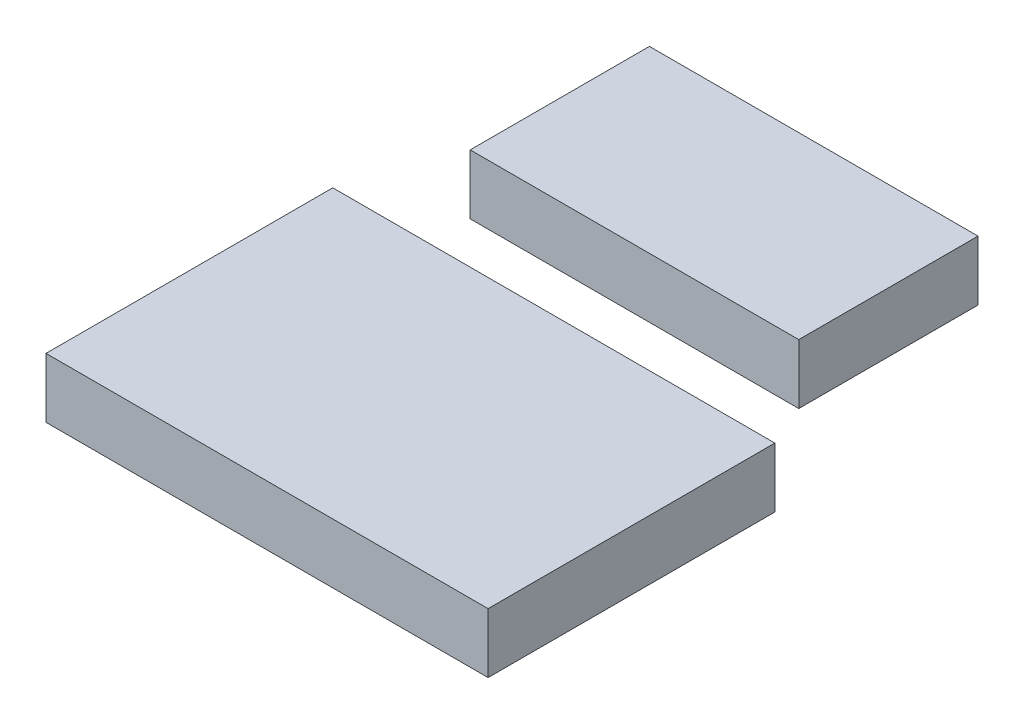
ISO-10303-21;
HEADER;
FILE_DESCRIPTION(('STEP AP214'),'2;1');
FILE_NAME('part.step','',(''),(''),'','','');
FILE_SCHEMA(('AUTOMOTIVE_DESIGN { 1 0 10303 214 1 1 1 1 }'));
ENDSEC;
DATA;
#1=APPLICATION_CONTEXT('core data for automotive mechanical design processes');
#2=APPLICATION_PROTOCOL_DEFINITION('international standard','automotive_design',2000,#1);
#3=PRODUCT_CONTEXT('',#1,'mechanical');
#4=PRODUCT('Part','Part','',(#3));
#5=PRODUCT_RELATED_PRODUCT_CATEGORY('part','',(#4));
#6=PRODUCT_DEFINITION_FORMATION('','',#4);
#7=PRODUCT_DEFINITION_CONTEXT('part definition',#1,'design');
#8=PRODUCT_DEFINITION('design','',#6,#7);
#9=PRODUCT_DEFINITION_SHAPE('','',#8);
#10=(LENGTH_UNIT() NAMED_UNIT(*) SI_UNIT(.MILLI.,.METRE.));
#11=(NAMED_UNIT(*) PLANE_ANGLE_UNIT() SI_UNIT($,.RADIAN.));
#12=(NAMED_UNIT(*) SI_UNIT($,.STERADIAN.) SOLID_ANGLE_UNIT());
#13=UNCERTAINTY_MEASURE_WITH_UNIT(LENGTH_MEASURE(1.E-05),#10,'distance_accuracy_value','');
#14=(GEOMETRIC_REPRESENTATION_CONTEXT(3) GLOBAL_UNCERTAINTY_ASSIGNED_CONTEXT((#13)) GLOBAL_UNIT_ASSIGNED_CONTEXT((#10,
#11,#12)) REPRESENTATION_CONTEXT('',''));
#15=CARTESIAN_POINT('',(0.,0.,0.));
#16=DIRECTION('',(0.,0.,1.));
#17=DIRECTION('',(1.,0.,0.));
#18=AXIS2_PLACEMENT_3D('',#15,#16,#17);
#19=CARTESIAN_POINT('',(-31.,10.,0.));
#20=DIRECTION('',(1.,0.,0.));
#21=DIRECTION('',(0.,0.,-1.));
#22=AXIS2_PLACEMENT_3D('',#19,#20,#21);
#23=PLANE('',#22);
#24=DIRECTION('',(0.,0.,1.));
#25=VECTOR('',#24,1.);
#26=CARTESIAN_POINT('',(-31.,0.,0.));
#27=LINE('',#26,#25);
#28=CARTESIAN_POINT('',(-31.,0.,-47.5));
#29=VERTEX_POINT('',#28);
#30=CARTESIAN_POINT('',(-31.,0.,-17.5));
#31=VERTEX_POINT('',#30);
#32=EDGE_CURVE('E105',#29,#31,#27,.T.);
#33=ORIENTED_EDGE('',*,*,#32,.T.);
#34=DIRECTION('',(0.,-1.,0.));
#35=VECTOR('',#34,1.);
#36=CARTESIAN_POINT('',(-31.,10.,-17.5));
#37=LINE('',#36,#35);
#38=CARTESIAN_POINT('',(-31.,10.,-17.5));
#39=VERTEX_POINT('',#38);
#40=EDGE_CURVE('E12',#39,#31,#37,.T.);
#41=ORIENTED_EDGE('',*,*,#40,.F.);
#42=DIRECTION('',(0.,0.,1.));
#43=VECTOR('',#42,1.);
#44=CARTESIAN_POINT('',(-31.,10.,0.));
#45=LINE('',#44,#43);
#46=CARTESIAN_POINT('',(-31.,10.,-47.5));
#47=VERTEX_POINT('',#46);
#48=EDGE_CURVE('E91',#47,#39,#45,.T.);
#49=ORIENTED_EDGE('',*,*,#48,.F.);
#50=DIRECTION('',(0.,-1.,0.));
#51=VECTOR('',#50,1.);
#52=CARTESIAN_POINT('',(-31.,10.,-47.5));
#53=LINE('',#52,#51);
#54=EDGE_CURVE('E58',#47,#29,#53,.T.);
#55=ORIENTED_EDGE('',*,*,#54,.T.);
#56=EDGE_LOOP('',(#33,#41,#49,#55));
#57=FACE_BOUND('',#56,.T.);
#58=ADVANCED_FACE('F42',(#57),#23,.F.);
#59=CARTESIAN_POINT('',(0.,10.,-17.5));
#60=DIRECTION('',(0.,0.,-1.));
#61=DIRECTION('',(-1.,0.,0.));
#62=AXIS2_PLACEMENT_3D('',#59,#60,#61);
#63=PLANE('',#62);
#64=DIRECTION('',(1.,0.,0.));
#65=VECTOR('',#64,1.);
#66=CARTESIAN_POINT('',(0.,0.,-17.5));
#67=LINE('',#66,#65);
#68=CARTESIAN_POINT('',(24.,0.,-17.5));
#69=VERTEX_POINT('',#68);
#70=EDGE_CURVE('E96',#31,#69,#67,.T.);
#71=ORIENTED_EDGE('',*,*,#70,.T.);
#72=DIRECTION('',(0.,-1.,0.));
#73=VECTOR('',#72,1.);
#74=CARTESIAN_POINT('',(24.,10.,-17.5));
#75=LINE('',#74,#73);
#76=CARTESIAN_POINT('',(24.,10.,-17.5));
#77=VERTEX_POINT('',#76);
#78=EDGE_CURVE('E50',#77,#69,#75,.T.);
#79=ORIENTED_EDGE('',*,*,#78,.F.);
#80=DIRECTION('',(1.,0.,0.));
#81=VECTOR('',#80,1.);
#82=CARTESIAN_POINT('',(0.,10.,-17.5));
#83=LINE('',#82,#81);
#84=EDGE_CURVE('E83',#39,#77,#83,.T.);
#85=ORIENTED_EDGE('',*,*,#84,.F.);
#86=ORIENTED_EDGE('',*,*,#40,.T.);
#87=EDGE_LOOP('',(#71,#79,#85,#86));
#88=FACE_BOUND('',#87,.T.);
#89=ADVANCED_FACE('F95',(#88),#63,.F.);
#90=CARTESIAN_POINT('',(24.,10.,0.));
#91=DIRECTION('',(1.,0.,0.));
#92=DIRECTION('',(0.,0.,-1.));
#93=AXIS2_PLACEMENT_3D('',#90,#91,#92);
#94=PLANE('',#93);
#95=DIRECTION('',(0.,0.,1.));
#96=VECTOR('',#95,1.);
#97=CARTESIAN_POINT('',(24.,0.,0.));
#98=LINE('',#97,#96);
#99=CARTESIAN_POINT('',(24.,0.,-47.5));
#100=VERTEX_POINT('',#99);
#101=EDGE_CURVE('E108',#100,#69,#98,.T.);
#102=ORIENTED_EDGE('',*,*,#101,.F.);
#103=DIRECTION('',(0.,-1.,0.));
#104=VECTOR('',#103,1.);
#105=CARTESIAN_POINT('',(24.,10.,-47.5));
#106=LINE('',#105,#104);
#107=CARTESIAN_POINT('',(24.,10.,-47.5));
#108=VERTEX_POINT('',#107);
#109=EDGE_CURVE('E72',#108,#100,#106,.T.);
#110=ORIENTED_EDGE('',*,*,#109,.F.);
#111=DIRECTION('',(0.,0.,1.));
#112=VECTOR('',#111,1.);
#113=CARTESIAN_POINT('',(24.,10.,0.));
#114=LINE('',#113,#112);
#115=EDGE_CURVE('E90',#108,#77,#114,.T.);
#116=ORIENTED_EDGE('',*,*,#115,.T.);
#117=ORIENTED_EDGE('',*,*,#78,.T.);
#118=EDGE_LOOP('',(#102,#110,#116,#117));
#119=FACE_BOUND('',#118,.T.);
#120=ADVANCED_FACE('F99',(#119),#94,.T.);
#121=CARTESIAN_POINT('',(0.,10.,-47.5));
#122=DIRECTION('',(0.,0.,-1.));
#123=DIRECTION('',(-1.,0.,0.));
#124=AXIS2_PLACEMENT_3D('',#121,#122,#123);
#125=PLANE('',#124);
#126=DIRECTION('',(1.,0.,0.));
#127=VECTOR('',#126,1.);
#128=CARTESIAN_POINT('',(0.,0.,-47.5));
#129=LINE('',#128,#127);
#130=EDGE_CURVE('E110',#29,#100,#129,.T.);
#131=ORIENTED_EDGE('',*,*,#130,.F.);
#132=ORIENTED_EDGE('',*,*,#54,.F.);
#133=DIRECTION('',(1.,0.,0.));
#134=VECTOR('',#133,1.);
#135=CARTESIAN_POINT('',(0.,10.,-47.5));
#136=LINE('',#135,#134);
#137=EDGE_CURVE('E100',#47,#108,#136,.T.);
#138=ORIENTED_EDGE('',*,*,#137,.T.);
#139=ORIENTED_EDGE('',*,*,#109,.T.);
#140=EDGE_LOOP('',(#131,#132,#138,#139));
#141=FACE_BOUND('',#140,.T.);
#142=ADVANCED_FACE('F116',(#141),#125,.T.);
#143=CARTESIAN_POINT('',(0.,10.,0.));
#144=DIRECTION('',(0.,1.,0.));
#145=DIRECTION('',(0.,0.,1.));
#146=AXIS2_PLACEMENT_3D('',#143,#144,#145);
#147=PLANE('',#146);
#148=ORIENTED_EDGE('',*,*,#48,.T.);
#149=ORIENTED_EDGE('',*,*,#84,.T.);
#150=ORIENTED_EDGE('',*,*,#115,.F.);
#151=ORIENTED_EDGE('',*,*,#137,.F.);
#152=EDGE_LOOP('',(#148,#149,#150,#151));
#153=FACE_BOUND('',#152,.T.);
#154=ADVANCED_FACE('F87',(#153),#147,.T.);
#155=CARTESIAN_POINT('',(0.,0.,0.));
#156=DIRECTION('',(0.,1.,0.));
#157=DIRECTION('',(0.,0.,1.));
#158=AXIS2_PLACEMENT_3D('',#155,#156,#157);
#159=PLANE('',#158);
#160=ORIENTED_EDGE('',*,*,#32,.F.);
#161=ORIENTED_EDGE('',*,*,#130,.T.);
#162=ORIENTED_EDGE('',*,*,#101,.T.);
#163=ORIENTED_EDGE('',*,*,#70,.F.);
#164=EDGE_LOOP('',(#160,#161,#162,#163));
#165=FACE_BOUND('',#164,.T.);
#166=ADVANCED_FACE('F115',(#165),#159,.F.);
#167=CLOSED_SHELL('',(#58,#89,#120,#142,#154,#166));
#168=MANIFOLD_SOLID_BREP('B2',#167);
#169=CARTESIAN_POINT('',(0.,10.,-0.5));
#170=DIRECTION('',(0.,0.,-1.));
#171=DIRECTION('',(-1.,0.,0.));
#172=AXIS2_PLACEMENT_3D('',#169,#170,#171);
#173=PLANE('',#172);
#174=DIRECTION('',(1.,0.,0.));
#175=VECTOR('',#174,1.);
#176=CARTESIAN_POINT('',(0.,0.,-0.5));
#177=LINE('',#176,#175);
#178=CARTESIAN_POINT('',(-37.,0.,-0.5));
#179=VERTEX_POINT('',#178);
#180=CARTESIAN_POINT('',(37.,0.,-0.5));
#181=VERTEX_POINT('',#180);
#182=EDGE_CURVE('E240',#179,#181,#177,.T.);
#183=ORIENTED_EDGE('',*,*,#182,.F.);
#184=DIRECTION('',(0.,-1.,0.));
#185=VECTOR('',#184,1.);
#186=CARTESIAN_POINT('',(-37.,10.,-0.5));
#187=LINE('',#186,#185);
#188=CARTESIAN_POINT('',(-37.,10.,-0.5));
#189=VERTEX_POINT('',#188);
#190=EDGE_CURVE('E40',#189,#179,#187,.T.);
#191=ORIENTED_EDGE('',*,*,#190,.F.);
#192=DIRECTION('',(1.,0.,0.));
#193=VECTOR('',#192,1.);
#194=CARTESIAN_POINT('',(0.,10.,-0.5));
#195=LINE('',#194,#193);
#196=CARTESIAN_POINT('',(37.,10.,-0.5));
#197=VERTEX_POINT('',#196);
#198=EDGE_CURVE('E225',#189,#197,#195,.T.);
#199=ORIENTED_EDGE('',*,*,#198,.T.);
#200=DIRECTION('',(0.,-1.,0.));
#201=VECTOR('',#200,1.);
#202=CARTESIAN_POINT('',(37.,10.,-0.5));
#203=LINE('',#202,#201);
#204=EDGE_CURVE('E193',#197,#181,#203,.T.);
#205=ORIENTED_EDGE('',*,*,#204,.T.);
#206=EDGE_LOOP('',(#183,#191,#199,#205));
#207=FACE_BOUND('',#206,.T.);
#208=ADVANCED_FACE('F177',(#207),#173,.T.);
#209=CARTESIAN_POINT('',(-37.,10.,0.));
#210=DIRECTION('',(1.,0.,0.));
#211=DIRECTION('',(0.,0.,-1.));
#212=AXIS2_PLACEMENT_3D('',#209,#210,#211);
#213=PLANE('',#212);
#214=DIRECTION('',(0.,0.,1.));
#215=VECTOR('',#214,1.);
#216=CARTESIAN_POINT('',(-37.,0.,0.));
#217=LINE('',#216,#215);
#218=CARTESIAN_POINT('',(-37.,0.,47.5));
#219=VERTEX_POINT('',#218);
#220=EDGE_CURVE('E231',#179,#219,#217,.T.);
#221=ORIENTED_EDGE('',*,*,#220,.T.);
#222=DIRECTION('',(0.,-1.,0.));
#223=VECTOR('',#222,1.);
#224=CARTESIAN_POINT('',(-37.,10.,47.5));
#225=LINE('',#224,#223);
#226=CARTESIAN_POINT('',(-37.,10.,47.5));
#227=VERTEX_POINT('',#226);
#228=EDGE_CURVE('E185',#227,#219,#225,.T.);
#229=ORIENTED_EDGE('',*,*,#228,.F.);
#230=DIRECTION('',(0.,0.,1.));
#231=VECTOR('',#230,1.);
#232=CARTESIAN_POINT('',(-37.,10.,0.));
#233=LINE('',#232,#231);
#234=EDGE_CURVE('E219',#189,#227,#233,.T.);
#235=ORIENTED_EDGE('',*,*,#234,.F.);
#236=ORIENTED_EDGE('',*,*,#190,.T.);
#237=EDGE_LOOP('',(#221,#229,#235,#236));
#238=FACE_BOUND('',#237,.T.);
#239=ADVANCED_FACE('F229',(#238),#213,.F.);
#240=CARTESIAN_POINT('',(0.,10.,47.5));
#241=DIRECTION('',(0.,0.,-1.));
#242=DIRECTION('',(-1.,0.,0.));
#243=AXIS2_PLACEMENT_3D('',#240,#241,#242);
#244=PLANE('',#243);
#245=DIRECTION('',(1.,0.,0.));
#246=VECTOR('',#245,1.);
#247=CARTESIAN_POINT('',(0.,0.,47.5));
#248=LINE('',#247,#246);
#249=CARTESIAN_POINT('',(37.,0.,47.5));
#250=VERTEX_POINT('',#249);
#251=EDGE_CURVE('E243',#219,#250,#248,.T.);
#252=ORIENTED_EDGE('',*,*,#251,.T.);
#253=DIRECTION('',(0.,-1.,0.));
#254=VECTOR('',#253,1.);
#255=CARTESIAN_POINT('',(37.,10.,47.5));
#256=LINE('',#255,#254);
#257=CARTESIAN_POINT('',(37.,10.,47.5));
#258=VERTEX_POINT('',#257);
#259=EDGE_CURVE('E207',#258,#250,#256,.T.);
#260=ORIENTED_EDGE('',*,*,#259,.F.);
#261=DIRECTION('',(1.,0.,0.));
#262=VECTOR('',#261,1.);
#263=CARTESIAN_POINT('',(0.,10.,47.5));
#264=LINE('',#263,#262);
#265=EDGE_CURVE('E224',#227,#258,#264,.T.);
#266=ORIENTED_EDGE('',*,*,#265,.F.);
#267=ORIENTED_EDGE('',*,*,#228,.T.);
#268=EDGE_LOOP('',(#252,#260,#266,#267));
#269=FACE_BOUND('',#268,.T.);
#270=ADVANCED_FACE('F234',(#269),#244,.F.);
#271=CARTESIAN_POINT('',(37.,10.,0.));
#272=DIRECTION('',(1.,0.,0.));
#273=DIRECTION('',(0.,0.,-1.));
#274=AXIS2_PLACEMENT_3D('',#271,#272,#273);
#275=PLANE('',#274);
#276=DIRECTION('',(0.,0.,1.));
#277=VECTOR('',#276,1.);
#278=CARTESIAN_POINT('',(37.,0.,0.));
#279=LINE('',#278,#277);
#280=EDGE_CURVE('E245',#181,#250,#279,.T.);
#281=ORIENTED_EDGE('',*,*,#280,.F.);
#282=ORIENTED_EDGE('',*,*,#204,.F.);
#283=DIRECTION('',(0.,0.,1.));
#284=VECTOR('',#283,1.);
#285=CARTESIAN_POINT('',(37.,10.,0.));
#286=LINE('',#285,#284);
#287=EDGE_CURVE('E235',#197,#258,#286,.T.);
#288=ORIENTED_EDGE('',*,*,#287,.T.);
#289=ORIENTED_EDGE('',*,*,#259,.T.);
#290=EDGE_LOOP('',(#281,#282,#288,#289));
#291=FACE_BOUND('',#290,.T.);
#292=ADVANCED_FACE('F250',(#291),#275,.T.);
#293=CARTESIAN_POINT('',(0.,10.,0.));
#294=DIRECTION('',(0.,1.,0.));
#295=DIRECTION('',(0.,0.,1.));
#296=AXIS2_PLACEMENT_3D('',#293,#294,#295);
#297=PLANE('',#296);
#298=ORIENTED_EDGE('',*,*,#198,.F.);
#299=ORIENTED_EDGE('',*,*,#234,.T.);
#300=ORIENTED_EDGE('',*,*,#265,.T.);
#301=ORIENTED_EDGE('',*,*,#287,.F.);
#302=EDGE_LOOP('',(#298,#299,#300,#301));
#303=FACE_BOUND('',#302,.T.);
#304=ADVANCED_FACE('F221',(#303),#297,.T.);
#305=CARTESIAN_POINT('',(0.,0.,0.));
#306=DIRECTION('',(0.,1.,0.));
#307=DIRECTION('',(0.,0.,1.));
#308=AXIS2_PLACEMENT_3D('',#305,#306,#307);
#309=PLANE('',#308);
#310=ORIENTED_EDGE('',*,*,#182,.T.);
#311=ORIENTED_EDGE('',*,*,#280,.T.);
#312=ORIENTED_EDGE('',*,*,#251,.F.);
#313=ORIENTED_EDGE('',*,*,#220,.F.);
#314=EDGE_LOOP('',(#310,#311,#312,#313));
#315=FACE_BOUND('',#314,.T.);
#316=ADVANCED_FACE('F257',(#315),#309,.F.);
#317=CLOSED_SHELL('',(#208,#239,#270,#292,#304,#316));
#318=MANIFOLD_SOLID_BREP('B6',#317);
#319=ADVANCED_BREP_SHAPE_REPRESENTATION('',(#18,#168,#318),#14);
#320=SHAPE_DEFINITION_REPRESENTATION(#9,#319);
ENDSEC;
END-ISO-10303-21;
